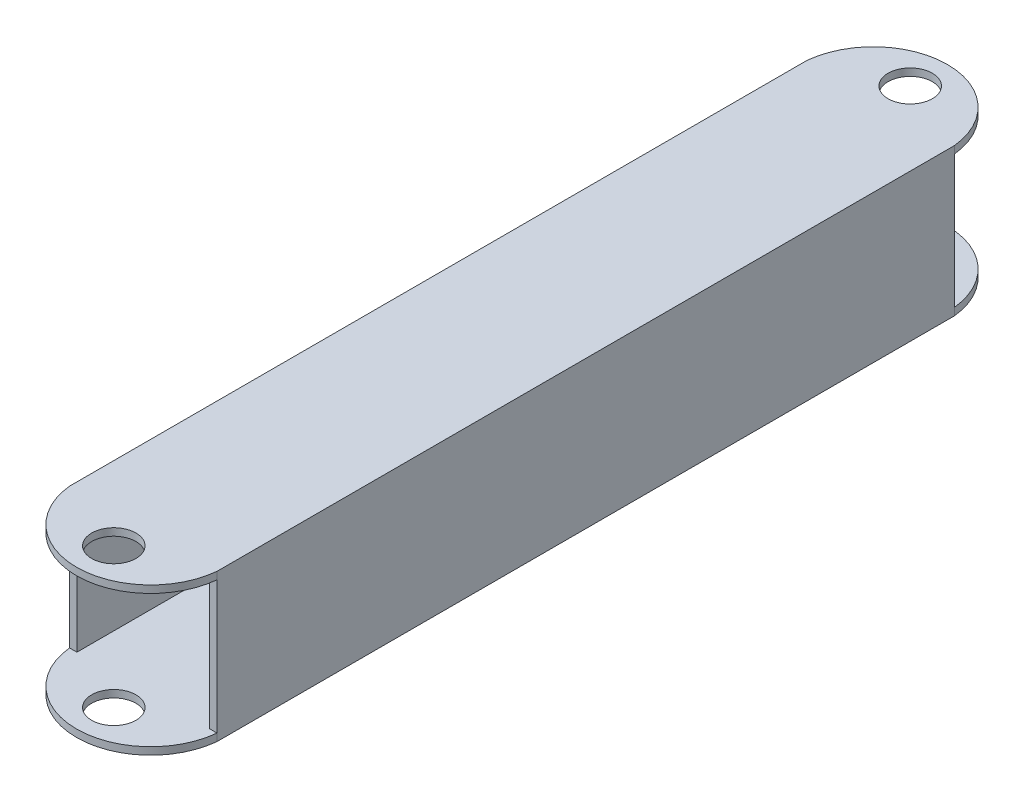
ISO-10303-21;
HEADER;
FILE_DESCRIPTION(('STEP AP214'),'2;1');
FILE_NAME('part.step','',(''),(''),'','','');
FILE_SCHEMA(('AUTOMOTIVE_DESIGN { 1 0 10303 214 1 1 1 1 }'));
ENDSEC;
DATA;
#1=APPLICATION_CONTEXT('core data for automotive mechanical design processes');
#2=APPLICATION_PROTOCOL_DEFINITION('international standard','automotive_design',2000,#1);
#3=PRODUCT_CONTEXT('',#1,'mechanical');
#4=PRODUCT('Part','Part','',(#3));
#5=PRODUCT_RELATED_PRODUCT_CATEGORY('part','',(#4));
#6=PRODUCT_DEFINITION_FORMATION('','',#4);
#7=PRODUCT_DEFINITION_CONTEXT('part definition',#1,'design');
#8=PRODUCT_DEFINITION('design','',#6,#7);
#9=PRODUCT_DEFINITION_SHAPE('','',#8);
#10=(LENGTH_UNIT() NAMED_UNIT(*) SI_UNIT(.MILLI.,.METRE.));
#11=(NAMED_UNIT(*) PLANE_ANGLE_UNIT() SI_UNIT($,.RADIAN.));
#12=(NAMED_UNIT(*) SI_UNIT($,.STERADIAN.) SOLID_ANGLE_UNIT());
#13=UNCERTAINTY_MEASURE_WITH_UNIT(LENGTH_MEASURE(1.E-05),#10,'distance_accuracy_value','');
#14=(GEOMETRIC_REPRESENTATION_CONTEXT(3) GLOBAL_UNCERTAINTY_ASSIGNED_CONTEXT((#13)) GLOBAL_UNIT_ASSIGNED_CONTEXT((#10,
#11,#12)) REPRESENTATION_CONTEXT('',''));
#15=CARTESIAN_POINT('',(0.,0.,0.));
#16=DIRECTION('',(0.,0.,1.));
#17=DIRECTION('',(1.,0.,0.));
#18=AXIS2_PLACEMENT_3D('',#15,#16,#17);
#19=CARTESIAN_POINT('',(0.,0.,50.));
#20=DIRECTION('',(0.,0.,-1.));
#21=DIRECTION('',(-1.,0.,0.));
#22=AXIS2_PLACEMENT_3D('',#19,#20,#21);
#23=PLANE('',#22);
#24=DIRECTION('',(0.,1.,0.));
#25=VECTOR('',#24,1.);
#26=CARTESIAN_POINT('',(10.,-10.,50.));
#27=LINE('',#26,#25);
#28=CARTESIAN_POINT('',(10.,-9.,50.));
#29=VERTEX_POINT('',#28);
#30=CARTESIAN_POINT('',(10.,9.,50.));
#31=VERTEX_POINT('',#30);
#32=EDGE_CURVE('E160',#29,#31,#27,.T.);
#33=ORIENTED_EDGE('',*,*,#32,.T.);
#34=DIRECTION('',(1.,0.,0.));
#35=VECTOR('',#34,1.);
#36=CARTESIAN_POINT('',(-10.,9.,50.));
#37=LINE('',#36,#35);
#38=CARTESIAN_POINT('',(9.,9.,50.));
#39=VERTEX_POINT('',#38);
#40=EDGE_CURVE('E130',#39,#31,#37,.T.);
#41=ORIENTED_EDGE('',*,*,#40,.F.);
#42=DIRECTION('',(0.,1.,0.));
#43=VECTOR('',#42,1.);
#44=CARTESIAN_POINT('',(9.,-9.,50.));
#45=LINE('',#44,#43);
#46=CARTESIAN_POINT('',(9.,-9.,50.));
#47=VERTEX_POINT('',#46);
#48=EDGE_CURVE('E274',#47,#39,#45,.T.);
#49=ORIENTED_EDGE('',*,*,#48,.F.);
#50=DIRECTION('',(1.,0.,0.));
#51=VECTOR('',#50,1.);
#52=CARTESIAN_POINT('',(-10.,-9.,50.));
#53=LINE('',#52,#51);
#54=EDGE_CURVE('E165',#47,#29,#53,.T.);
#55=ORIENTED_EDGE('',*,*,#54,.T.);
#56=EDGE_LOOP('',(#33,#41,#49,#55));
#57=FACE_BOUND('',#56,.T.);
#58=ADVANCED_FACE('F39',(#57),#23,.F.);
#59=CARTESIAN_POINT('',(0.,0.,-50.));
#60=DIRECTION('',(0.,0.,-1.));
#61=DIRECTION('',(-1.,0.,0.));
#62=AXIS2_PLACEMENT_3D('',#59,#60,#61);
#63=PLANE('',#62);
#64=DIRECTION('',(1.,0.,0.));
#65=VECTOR('',#64,1.);
#66=CARTESIAN_POINT('',(-10.,9.,-50.));
#67=LINE('',#66,#65);
#68=CARTESIAN_POINT('',(9.,9.,-50.));
#69=VERTEX_POINT('',#68);
#70=CARTESIAN_POINT('',(10.,9.,-50.));
#71=VERTEX_POINT('',#70);
#72=EDGE_CURVE('E55',#69,#71,#67,.T.);
#73=ORIENTED_EDGE('',*,*,#72,.T.);
#74=DIRECTION('',(0.,1.,0.));
#75=VECTOR('',#74,1.);
#76=CARTESIAN_POINT('',(10.,-10.,-50.));
#77=LINE('',#76,#75);
#78=CARTESIAN_POINT('',(10.,-9.,-50.));
#79=VERTEX_POINT('',#78);
#80=EDGE_CURVE('E183',#79,#71,#77,.T.);
#81=ORIENTED_EDGE('',*,*,#80,.F.);
#82=DIRECTION('',(1.,0.,0.));
#83=VECTOR('',#82,1.);
#84=CARTESIAN_POINT('',(-10.,-9.,-50.));
#85=LINE('',#84,#83);
#86=CARTESIAN_POINT('',(9.,-9.,-50.));
#87=VERTEX_POINT('',#86);
#88=EDGE_CURVE('E236',#87,#79,#85,.T.);
#89=ORIENTED_EDGE('',*,*,#88,.F.);
#90=DIRECTION('',(0.,1.,0.));
#91=VECTOR('',#90,1.);
#92=CARTESIAN_POINT('',(9.,-9.,-50.));
#93=LINE('',#92,#91);
#94=EDGE_CURVE('E275',#87,#69,#93,.T.);
#95=ORIENTED_EDGE('',*,*,#94,.T.);
#96=EDGE_LOOP('',(#73,#81,#89,#95));
#97=FACE_BOUND('',#96,.T.);
#98=ADVANCED_FACE('F363',(#97),#63,.T.);
#99=DIRECTION('',(0.,-1.,0.));
#100=VECTOR('',#99,1.);
#101=CARTESIAN_POINT('',(-9.,-9.,50.));
#102=LINE('',#101,#100);
#103=CARTESIAN_POINT('',(-9.,9.,50.));
#104=VERTEX_POINT('',#103);
#105=CARTESIAN_POINT('',(-9.,-9.,50.));
#106=VERTEX_POINT('',#105);
#107=EDGE_CURVE('E270',#104,#106,#102,.T.);
#108=ORIENTED_EDGE('',*,*,#107,.F.);
#109=CARTESIAN_POINT('',(-10.,9.,50.));
#110=VERTEX_POINT('',#109);
#111=EDGE_CURVE('E142',#110,#104,#37,.T.);
#112=ORIENTED_EDGE('',*,*,#111,.F.);
#113=DIRECTION('',(0.,-1.,0.));
#114=VECTOR('',#113,1.);
#115=CARTESIAN_POINT('',(-10.,-10.,50.));
#116=LINE('',#115,#114);
#117=CARTESIAN_POINT('',(-10.,-9.,50.));
#118=VERTEX_POINT('',#117);
#119=EDGE_CURVE('E172',#110,#118,#116,.T.);
#120=ORIENTED_EDGE('',*,*,#119,.T.);
#121=EDGE_CURVE('E260',#118,#106,#53,.T.);
#122=ORIENTED_EDGE('',*,*,#121,.T.);
#123=EDGE_LOOP('',(#108,#112,#120,#122));
#124=FACE_BOUND('',#123,.T.);
#125=ADVANCED_FACE('F325',(#124),#23,.F.);
#126=CARTESIAN_POINT('',(-10.,9.,-50.));
#127=VERTEX_POINT('',#126);
#128=CARTESIAN_POINT('',(-9.,9.,-50.));
#129=VERTEX_POINT('',#128);
#130=EDGE_CURVE('E219',#127,#129,#67,.T.);
#131=ORIENTED_EDGE('',*,*,#130,.T.);
#132=DIRECTION('',(0.,-1.,0.));
#133=VECTOR('',#132,1.);
#134=CARTESIAN_POINT('',(-9.,-9.,-50.));
#135=LINE('',#134,#133);
#136=CARTESIAN_POINT('',(-9.,-9.,-50.));
#137=VERTEX_POINT('',#136);
#138=EDGE_CURVE('E269',#129,#137,#135,.T.);
#139=ORIENTED_EDGE('',*,*,#138,.T.);
#140=CARTESIAN_POINT('',(-10.,-9.,-50.));
#141=VERTEX_POINT('',#140);
#142=EDGE_CURVE('E237',#141,#137,#85,.T.);
#143=ORIENTED_EDGE('',*,*,#142,.F.);
#144=DIRECTION('',(0.,-1.,0.));
#145=VECTOR('',#144,1.);
#146=CARTESIAN_POINT('',(-10.,-10.,-50.));
#147=LINE('',#146,#145);
#148=EDGE_CURVE('E63',#127,#141,#147,.T.);
#149=ORIENTED_EDGE('',*,*,#148,.F.);
#150=EDGE_LOOP('',(#131,#139,#143,#149));
#151=FACE_BOUND('',#150,.T.);
#152=ADVANCED_FACE('F369',(#151),#63,.T.);
#153=CARTESIAN_POINT('',(10.,-10.,50.));
#154=DIRECTION('',(-1.,0.,0.));
#155=DIRECTION('',(0.,0.,1.));
#156=AXIS2_PLACEMENT_3D('',#153,#154,#155);
#157=PLANE('',#156);
#158=CARTESIAN_POINT('',(10.,-10.,-50.));
#159=VERTEX_POINT('',#158);
#160=EDGE_CURVE('E181',#159,#79,#77,.T.);
#161=ORIENTED_EDGE('',*,*,#160,.T.);
#162=ORIENTED_EDGE('',*,*,#80,.T.);
#163=DIRECTION('',(0.,1.,0.));
#164=VECTOR('',#163,1.);
#165=CARTESIAN_POINT('',(10.,9.,-50.));
#166=LINE('',#165,#164);
#167=CARTESIAN_POINT('',(10.,10.,-50.));
#168=VERTEX_POINT('',#167);
#169=EDGE_CURVE('E220',#71,#168,#166,.T.);
#170=ORIENTED_EDGE('',*,*,#169,.T.);
#171=DIRECTION('',(0.,0.,-1.));
#172=VECTOR('',#171,1.);
#173=CARTESIAN_POINT('',(10.,10.,50.));
#174=LINE('',#173,#172);
#175=CARTESIAN_POINT('',(10.,10.,50.));
#176=VERTEX_POINT('',#175);
#177=EDGE_CURVE('E11',#176,#168,#174,.T.);
#178=ORIENTED_EDGE('',*,*,#177,.F.);
#179=DIRECTION('',(0.,1.,0.));
#180=VECTOR('',#179,1.);
#181=CARTESIAN_POINT('',(10.,9.,50.));
#182=LINE('',#181,#180);
#183=EDGE_CURVE('E147',#31,#176,#182,.T.);
#184=ORIENTED_EDGE('',*,*,#183,.F.);
#185=ORIENTED_EDGE('',*,*,#32,.F.);
#186=CARTESIAN_POINT('',(10.,-10.,50.));
#187=VERTEX_POINT('',#186);
#188=EDGE_CURVE('E167',#187,#29,#27,.T.);
#189=ORIENTED_EDGE('',*,*,#188,.F.);
#190=DIRECTION('',(0.,0.,-1.));
#191=VECTOR('',#190,1.);
#192=CARTESIAN_POINT('',(10.,-10.,50.));
#193=LINE('',#192,#191);
#194=EDGE_CURVE('E180',#187,#159,#193,.T.);
#195=ORIENTED_EDGE('',*,*,#194,.T.);
#196=EDGE_LOOP('',(#161,#162,#170,#178,#184,#185,#189,#195));
#197=FACE_BOUND('',#196,.T.);
#198=ADVANCED_FACE('F41',(#197),#157,.F.);
#199=CARTESIAN_POINT('',(-10.,10.,50.));
#200=DIRECTION('',(0.,-1.,0.));
#201=DIRECTION('',(0.,0.,-1.));
#202=AXIS2_PLACEMENT_3D('',#199,#200,#201);
#203=PLANE('',#202);
#204=ORIENTED_EDGE('',*,*,#177,.T.);
#205=CARTESIAN_POINT('',(0.,10.,-49.));
#206=DIRECTION('',(0.,1.,0.));
#207=DIRECTION('',(0.,0.,-1.));
#208=AXIS2_PLACEMENT_3D('',#205,#206,#207);
#209=CIRCLE('',#208,10.0498756211209);
#210=CARTESIAN_POINT('',(-10.,10.,-50.));
#211=VERTEX_POINT('',#210);
#212=EDGE_CURVE('E203',#168,#211,#209,.T.);
#213=ORIENTED_EDGE('',*,*,#212,.T.);
#214=DIRECTION('',(0.,0.,-1.));
#215=VECTOR('',#214,1.);
#216=CARTESIAN_POINT('',(-10.,10.,50.));
#217=LINE('',#216,#215);
#218=CARTESIAN_POINT('',(-10.,10.,50.));
#219=VERTEX_POINT('',#218);
#220=EDGE_CURVE('E48',#219,#211,#217,.T.);
#221=ORIENTED_EDGE('',*,*,#220,.F.);
#222=CARTESIAN_POINT('',(0.,10.,49.));
#223=DIRECTION('',(0.,-1.,0.));
#224=DIRECTION('',(0.,0.,1.));
#225=AXIS2_PLACEMENT_3D('',#222,#223,#224);
#226=CIRCLE('',#225,10.0498756211209);
#227=EDGE_CURVE('E153',#176,#219,#226,.T.);
#228=ORIENTED_EDGE('',*,*,#227,.F.);
#229=EDGE_LOOP('',(#204,#213,#221,#228));
#230=FACE_BOUND('',#229,.T.);
#231=CARTESIAN_POINT('',(0.,10.,-54.));
#232=DIRECTION('',(0.,1.,0.));
#233=DIRECTION('',(0.,0.,1.));
#234=AXIS2_PLACEMENT_3D('',#231,#232,#233);
#235=CIRCLE('',#234,3.);
#236=CARTESIAN_POINT('',(0.,10.,-51.));
#237=VERTEX_POINT('',#236);
#238=EDGE_CURVE('E162',#237,#237,#235,.T.);
#239=ORIENTED_EDGE('',*,*,#238,.F.);
#240=EDGE_LOOP('',(#239));
#241=FACE_BOUND('',#240,.T.);
#242=CARTESIAN_POINT('',(0.,10.,54.));
#243=DIRECTION('',(0.,-1.,0.));
#244=DIRECTION('',(0.,0.,-1.));
#245=AXIS2_PLACEMENT_3D('',#242,#243,#244);
#246=CIRCLE('',#245,3.);
#247=CARTESIAN_POINT('',(0.,10.,51.));
#248=VERTEX_POINT('',#247);
#249=EDGE_CURVE('E341',#248,#248,#246,.T.);
#250=ORIENTED_EDGE('',*,*,#249,.T.);
#251=EDGE_LOOP('',(#250));
#252=FACE_BOUND('',#251,.T.);
#253=ADVANCED_FACE('F207',(#230,#241,#252),#203,.F.);
#254=CARTESIAN_POINT('',(-10.,-10.,50.));
#255=DIRECTION('',(1.,0.,0.));
#256=DIRECTION('',(0.,0.,-1.));
#257=AXIS2_PLACEMENT_3D('',#254,#255,#256);
#258=PLANE('',#257);
#259=EDGE_CURVE('E168',#211,#127,#147,.T.);
#260=ORIENTED_EDGE('',*,*,#259,.T.);
#261=ORIENTED_EDGE('',*,*,#148,.T.);
#262=DIRECTION('',(0.,-1.,0.));
#263=VECTOR('',#262,1.);
#264=CARTESIAN_POINT('',(-10.,-9.,-50.));
#265=LINE('',#264,#263);
#266=CARTESIAN_POINT('',(-10.,-10.,-50.));
#267=VERTEX_POINT('',#266);
#268=EDGE_CURVE('E241',#141,#267,#265,.T.);
#269=ORIENTED_EDGE('',*,*,#268,.T.);
#270=DIRECTION('',(0.,0.,-1.));
#271=VECTOR('',#270,1.);
#272=CARTESIAN_POINT('',(-10.,-10.,50.));
#273=LINE('',#272,#271);
#274=CARTESIAN_POINT('',(-10.,-10.,50.));
#275=VERTEX_POINT('',#274);
#276=EDGE_CURVE('E187',#275,#267,#273,.T.);
#277=ORIENTED_EDGE('',*,*,#276,.F.);
#278=DIRECTION('',(0.,-1.,0.));
#279=VECTOR('',#278,1.);
#280=CARTESIAN_POINT('',(-10.,-9.,50.));
#281=LINE('',#280,#279);
#282=EDGE_CURVE('E263',#118,#275,#281,.T.);
#283=ORIENTED_EDGE('',*,*,#282,.F.);
#284=ORIENTED_EDGE('',*,*,#119,.F.);
#285=EDGE_CURVE('E150',#219,#110,#116,.T.);
#286=ORIENTED_EDGE('',*,*,#285,.F.);
#287=ORIENTED_EDGE('',*,*,#220,.T.);
#288=EDGE_LOOP('',(#260,#261,#269,#277,#283,#284,#286,#287));
#289=FACE_BOUND('',#288,.T.);
#290=ADVANCED_FACE('F194',(#289),#258,.F.);
#291=CARTESIAN_POINT('',(-10.,-10.,50.));
#292=DIRECTION('',(0.,1.,0.));
#293=DIRECTION('',(0.,0.,1.));
#294=AXIS2_PLACEMENT_3D('',#291,#292,#293);
#295=PLANE('',#294);
#296=ORIENTED_EDGE('',*,*,#276,.T.);
#297=CARTESIAN_POINT('',(0.,-10.,-49.));
#298=DIRECTION('',(0.,1.,0.));
#299=DIRECTION('',(0.,0.,-1.));
#300=AXIS2_PLACEMENT_3D('',#297,#298,#299);
#301=CIRCLE('',#300,10.0498756211209);
#302=EDGE_CURVE('E228',#159,#267,#301,.T.);
#303=ORIENTED_EDGE('',*,*,#302,.F.);
#304=ORIENTED_EDGE('',*,*,#194,.F.);
#305=CARTESIAN_POINT('',(0.,-10.,49.));
#306=DIRECTION('',(0.,-1.,0.));
#307=DIRECTION('',(0.,0.,1.));
#308=AXIS2_PLACEMENT_3D('',#305,#306,#307);
#309=CIRCLE('',#308,10.0498756211209);
#310=EDGE_CURVE('E252',#187,#275,#309,.T.);
#311=ORIENTED_EDGE('',*,*,#310,.T.);
#312=EDGE_LOOP('',(#296,#303,#304,#311));
#313=FACE_BOUND('',#312,.T.);
#314=CARTESIAN_POINT('',(0.,-10.,54.));
#315=DIRECTION('',(0.,-1.,0.));
#316=DIRECTION('',(0.,0.,-1.));
#317=AXIS2_PLACEMENT_3D('',#314,#315,#316);
#318=CIRCLE('',#317,3.);
#319=CARTESIAN_POINT('',(0.,-10.,51.));
#320=VERTEX_POINT('',#319);
#321=EDGE_CURVE('E247',#320,#320,#318,.T.);
#322=ORIENTED_EDGE('',*,*,#321,.F.);
#323=EDGE_LOOP('',(#322));
#324=FACE_BOUND('',#323,.T.);
#325=CARTESIAN_POINT('',(0.,-10.,-54.));
#326=DIRECTION('',(0.,1.,0.));
#327=DIRECTION('',(0.,0.,1.));
#328=AXIS2_PLACEMENT_3D('',#325,#326,#327);
#329=CIRCLE('',#328,3.);
#330=CARTESIAN_POINT('',(0.,-10.,-51.));
#331=VERTEX_POINT('',#330);
#332=EDGE_CURVE('E223',#331,#331,#329,.T.);
#333=ORIENTED_EDGE('',*,*,#332,.T.);
#334=EDGE_LOOP('',(#333));
#335=FACE_BOUND('',#334,.T.);
#336=ADVANCED_FACE('F315',(#313,#324,#335),#295,.F.);
#337=CARTESIAN_POINT('',(-9.,-9.,50.));
#338=DIRECTION('',(1.,0.,0.));
#339=DIRECTION('',(0.,0.,-1.));
#340=AXIS2_PLACEMENT_3D('',#337,#338,#339);
#341=PLANE('',#340);
#342=ORIENTED_EDGE('',*,*,#138,.F.);
#343=DIRECTION('',(0.,0.,-1.));
#344=VECTOR('',#343,1.);
#345=CARTESIAN_POINT('',(-9.,9.,50.));
#346=LINE('',#345,#344);
#347=EDGE_CURVE('E278',#104,#129,#346,.T.);
#348=ORIENTED_EDGE('',*,*,#347,.F.);
#349=ORIENTED_EDGE('',*,*,#107,.T.);
#350=DIRECTION('',(0.,0.,-1.));
#351=VECTOR('',#350,1.);
#352=CARTESIAN_POINT('',(-9.,-9.,50.));
#353=LINE('',#352,#351);
#354=EDGE_CURVE('E176',#106,#137,#353,.T.);
#355=ORIENTED_EDGE('',*,*,#354,.T.);
#356=EDGE_LOOP('',(#342,#348,#349,#355));
#357=FACE_BOUND('',#356,.T.);
#358=ADVANCED_FACE('F381',(#357),#341,.T.);
#359=CARTESIAN_POINT('',(-9.,-9.,50.));
#360=DIRECTION('',(0.,1.,0.));
#361=DIRECTION('',(0.,0.,1.));
#362=AXIS2_PLACEMENT_3D('',#359,#360,#361);
#363=PLANE('',#362);
#364=DIRECTION('',(0.,0.,-1.));
#365=VECTOR('',#364,1.);
#366=CARTESIAN_POINT('',(9.,-9.,50.));
#367=LINE('',#366,#365);
#368=EDGE_CURVE('E287',#47,#87,#367,.T.);
#369=ORIENTED_EDGE('',*,*,#368,.T.);
#370=ORIENTED_EDGE('',*,*,#88,.T.);
#371=CARTESIAN_POINT('',(0.,-9.,-49.));
#372=DIRECTION('',(0.,1.,0.));
#373=DIRECTION('',(0.,0.,-1.));
#374=AXIS2_PLACEMENT_3D('',#371,#372,#373);
#375=CIRCLE('',#374,10.0498756211209);
#376=EDGE_CURVE('E232',#79,#141,#375,.T.);
#377=ORIENTED_EDGE('',*,*,#376,.T.);
#378=ORIENTED_EDGE('',*,*,#142,.T.);
#379=ORIENTED_EDGE('',*,*,#354,.F.);
#380=ORIENTED_EDGE('',*,*,#121,.F.);
#381=CARTESIAN_POINT('',(0.,-9.,49.));
#382=DIRECTION('',(0.,-1.,0.));
#383=DIRECTION('',(0.,0.,1.));
#384=AXIS2_PLACEMENT_3D('',#381,#382,#383);
#385=CIRCLE('',#384,10.0498756211209);
#386=EDGE_CURVE('E256',#29,#118,#385,.T.);
#387=ORIENTED_EDGE('',*,*,#386,.F.);
#388=ORIENTED_EDGE('',*,*,#54,.F.);
#389=EDGE_LOOP('',(#369,#370,#377,#378,#379,#380,#387,#388));
#390=FACE_BOUND('',#389,.T.);
#391=CARTESIAN_POINT('',(0.,-9.,54.));
#392=DIRECTION('',(0.,-1.,0.));
#393=DIRECTION('',(0.,0.,-1.));
#394=AXIS2_PLACEMENT_3D('',#391,#392,#393);
#395=CIRCLE('',#394,3.);
#396=CARTESIAN_POINT('',(0.,-9.,51.));
#397=VERTEX_POINT('',#396);
#398=EDGE_CURVE('E248',#397,#397,#395,.T.);
#399=ORIENTED_EDGE('',*,*,#398,.T.);
#400=EDGE_LOOP('',(#399));
#401=FACE_BOUND('',#400,.T.);
#402=CARTESIAN_POINT('',(0.,-9.,-54.));
#403=DIRECTION('',(0.,1.,0.));
#404=DIRECTION('',(0.,0.,1.));
#405=AXIS2_PLACEMENT_3D('',#402,#403,#404);
#406=CIRCLE('',#405,3.);
#407=CARTESIAN_POINT('',(0.,-9.,-51.));
#408=VERTEX_POINT('',#407);
#409=EDGE_CURVE('E224',#408,#408,#406,.T.);
#410=ORIENTED_EDGE('',*,*,#409,.F.);
#411=EDGE_LOOP('',(#410));
#412=FACE_BOUND('',#411,.T.);
#413=ADVANCED_FACE('F306',(#390,#401,#412),#363,.T.);
#414=CARTESIAN_POINT('',(9.,-9.,50.));
#415=DIRECTION('',(-1.,0.,0.));
#416=DIRECTION('',(0.,0.,1.));
#417=AXIS2_PLACEMENT_3D('',#414,#415,#416);
#418=PLANE('',#417);
#419=ORIENTED_EDGE('',*,*,#94,.F.);
#420=ORIENTED_EDGE('',*,*,#368,.F.);
#421=ORIENTED_EDGE('',*,*,#48,.T.);
#422=DIRECTION('',(0.,0.,-1.));
#423=VECTOR('',#422,1.);
#424=CARTESIAN_POINT('',(9.,9.,50.));
#425=LINE('',#424,#423);
#426=EDGE_CURVE('E136',#39,#69,#425,.T.);
#427=ORIENTED_EDGE('',*,*,#426,.T.);
#428=EDGE_LOOP('',(#419,#420,#421,#427));
#429=FACE_BOUND('',#428,.T.);
#430=ADVANCED_FACE('F352',(#429),#418,.T.);
#431=CARTESIAN_POINT('',(-9.,9.,50.));
#432=DIRECTION('',(0.,-1.,0.));
#433=DIRECTION('',(0.,0.,-1.));
#434=AXIS2_PLACEMENT_3D('',#431,#432,#433);
#435=PLANE('',#434);
#436=ORIENTED_EDGE('',*,*,#347,.T.);
#437=ORIENTED_EDGE('',*,*,#130,.F.);
#438=CARTESIAN_POINT('',(0.,9.,-49.));
#439=DIRECTION('',(0.,1.,0.));
#440=DIRECTION('',(0.,0.,-1.));
#441=AXIS2_PLACEMENT_3D('',#438,#439,#440);
#442=CIRCLE('',#441,10.0498756211209);
#443=EDGE_CURVE('E205',#71,#127,#442,.T.);
#444=ORIENTED_EDGE('',*,*,#443,.F.);
#445=ORIENTED_EDGE('',*,*,#72,.F.);
#446=ORIENTED_EDGE('',*,*,#426,.F.);
#447=ORIENTED_EDGE('',*,*,#40,.T.);
#448=CARTESIAN_POINT('',(0.,9.,49.));
#449=DIRECTION('',(0.,-1.,0.));
#450=DIRECTION('',(0.,0.,1.));
#451=AXIS2_PLACEMENT_3D('',#448,#449,#450);
#452=CIRCLE('',#451,10.0498756211209);
#453=EDGE_CURVE('E134',#31,#110,#452,.T.);
#454=ORIENTED_EDGE('',*,*,#453,.T.);
#455=ORIENTED_EDGE('',*,*,#111,.T.);
#456=EDGE_LOOP('',(#436,#437,#444,#445,#446,#447,#454,#455));
#457=FACE_BOUND('',#456,.T.);
#458=CARTESIAN_POINT('',(0.,9.,-54.));
#459=DIRECTION('',(0.,1.,0.));
#460=DIRECTION('',(0.,0.,1.));
#461=AXIS2_PLACEMENT_3D('',#458,#459,#460);
#462=CIRCLE('',#461,3.);
#463=CARTESIAN_POINT('',(0.,9.,-51.));
#464=VERTEX_POINT('',#463);
#465=EDGE_CURVE('E210',#464,#464,#462,.T.);
#466=ORIENTED_EDGE('',*,*,#465,.T.);
#467=EDGE_LOOP('',(#466));
#468=FACE_BOUND('',#467,.T.);
#469=CARTESIAN_POINT('',(0.,9.,54.));
#470=DIRECTION('',(0.,-1.,0.));
#471=DIRECTION('',(0.,0.,-1.));
#472=AXIS2_PLACEMENT_3D('',#469,#470,#471);
#473=CIRCLE('',#472,3.);
#474=CARTESIAN_POINT('',(0.,9.,51.));
#475=VERTEX_POINT('',#474);
#476=EDGE_CURVE('E330',#475,#475,#473,.T.);
#477=ORIENTED_EDGE('',*,*,#476,.F.);
#478=EDGE_LOOP('',(#477));
#479=FACE_BOUND('',#478,.T.);
#480=ADVANCED_FACE('F132',(#457,#468,#479),#435,.T.);
#481=CARTESIAN_POINT('',(0.,-9.,49.));
#482=DIRECTION('',(0.,-1.,0.));
#483=DIRECTION('',(0.,0.,-1.));
#484=AXIS2_PLACEMENT_3D('',#481,#482,#483);
#485=CYLINDRICAL_SURFACE('',#484,10.0498756211209);
#486=ORIENTED_EDGE('',*,*,#310,.F.);
#487=ORIENTED_EDGE('',*,*,#188,.T.);
#488=ORIENTED_EDGE('',*,*,#386,.T.);
#489=ORIENTED_EDGE('',*,*,#282,.T.);
#490=EDGE_LOOP('',(#486,#487,#488,#489));
#491=FACE_BOUND('',#490,.T.);
#492=ADVANCED_FACE('F319',(#491),#485,.T.);
#493=CARTESIAN_POINT('',(0.,-9.,54.));
#494=DIRECTION('',(0.,-1.,0.));
#495=DIRECTION('',(0.,0.,-1.));
#496=AXIS2_PLACEMENT_3D('',#493,#494,#495);
#497=CYLINDRICAL_SURFACE('',#496,3.);
#498=ORIENTED_EDGE('',*,*,#398,.F.);
#499=EDGE_LOOP('',(#498));
#500=FACE_BOUND('',#499,.T.);
#501=ORIENTED_EDGE('',*,*,#321,.T.);
#502=EDGE_LOOP('',(#501));
#503=FACE_BOUND('',#502,.T.);
#504=ADVANCED_FACE('F358',(#500,#503),#497,.F.);
#505=CARTESIAN_POINT('',(0.,-9.,-49.));
#506=DIRECTION('',(0.,-1.,0.));
#507=DIRECTION('',(0.,0.,-1.));
#508=AXIS2_PLACEMENT_3D('',#505,#506,#507);
#509=CYLINDRICAL_SURFACE('',#508,10.0498756211209);
#510=ORIENTED_EDGE('',*,*,#302,.T.);
#511=ORIENTED_EDGE('',*,*,#268,.F.);
#512=ORIENTED_EDGE('',*,*,#376,.F.);
#513=ORIENTED_EDGE('',*,*,#160,.F.);
#514=EDGE_LOOP('',(#510,#511,#512,#513));
#515=FACE_BOUND('',#514,.T.);
#516=ADVANCED_FACE('F310',(#515),#509,.T.);
#517=CARTESIAN_POINT('',(0.,-9.,-54.));
#518=DIRECTION('',(0.,-1.,0.));
#519=DIRECTION('',(0.,0.,-1.));
#520=AXIS2_PLACEMENT_3D('',#517,#518,#519);
#521=CYLINDRICAL_SURFACE('',#520,3.);
#522=ORIENTED_EDGE('',*,*,#409,.T.);
#523=EDGE_LOOP('',(#522));
#524=FACE_BOUND('',#523,.T.);
#525=ORIENTED_EDGE('',*,*,#332,.F.);
#526=EDGE_LOOP('',(#525));
#527=FACE_BOUND('',#526,.T.);
#528=ADVANCED_FACE('F424',(#524,#527),#521,.F.);
#529=CARTESIAN_POINT('',(0.,9.,-49.));
#530=DIRECTION('',(0.,1.,0.));
#531=DIRECTION('',(0.,0.,1.));
#532=AXIS2_PLACEMENT_3D('',#529,#530,#531);
#533=CYLINDRICAL_SURFACE('',#532,10.0498756211209);
#534=ORIENTED_EDGE('',*,*,#212,.F.);
#535=ORIENTED_EDGE('',*,*,#169,.F.);
#536=ORIENTED_EDGE('',*,*,#443,.T.);
#537=ORIENTED_EDGE('',*,*,#259,.F.);
#538=EDGE_LOOP('',(#534,#535,#536,#537));
#539=FACE_BOUND('',#538,.T.);
#540=ADVANCED_FACE('F201',(#539),#533,.T.);
#541=CARTESIAN_POINT('',(0.,9.,-54.));
#542=DIRECTION('',(0.,1.,0.));
#543=DIRECTION('',(0.,0.,1.));
#544=AXIS2_PLACEMENT_3D('',#541,#542,#543);
#545=CYLINDRICAL_SURFACE('',#544,3.);
#546=ORIENTED_EDGE('',*,*,#465,.F.);
#547=EDGE_LOOP('',(#546));
#548=FACE_BOUND('',#547,.T.);
#549=ORIENTED_EDGE('',*,*,#238,.T.);
#550=EDGE_LOOP('',(#549));
#551=FACE_BOUND('',#550,.T.);
#552=ADVANCED_FACE('F336',(#548,#551),#545,.F.);
#553=CARTESIAN_POINT('',(0.,9.,49.));
#554=DIRECTION('',(0.,1.,0.));
#555=DIRECTION('',(0.,0.,1.));
#556=AXIS2_PLACEMENT_3D('',#553,#554,#555);
#557=CYLINDRICAL_SURFACE('',#556,10.0498756211209);
#558=ORIENTED_EDGE('',*,*,#227,.T.);
#559=ORIENTED_EDGE('',*,*,#285,.T.);
#560=ORIENTED_EDGE('',*,*,#453,.F.);
#561=ORIENTED_EDGE('',*,*,#183,.T.);
#562=EDGE_LOOP('',(#558,#559,#560,#561));
#563=FACE_BOUND('',#562,.T.);
#564=ADVANCED_FACE('F146',(#563),#557,.T.);
#565=CARTESIAN_POINT('',(0.,9.,54.));
#566=DIRECTION('',(0.,1.,0.));
#567=DIRECTION('',(0.,0.,1.));
#568=AXIS2_PLACEMENT_3D('',#565,#566,#567);
#569=CYLINDRICAL_SURFACE('',#568,3.);
#570=ORIENTED_EDGE('',*,*,#476,.T.);
#571=EDGE_LOOP('',(#570));
#572=FACE_BOUND('',#571,.T.);
#573=ORIENTED_EDGE('',*,*,#249,.F.);
#574=EDGE_LOOP('',(#573));
#575=FACE_BOUND('',#574,.T.);
#576=ADVANCED_FACE('F349',(#572,#575),#569,.F.);
#577=CLOSED_SHELL('',(#58,#98,#125,#152,#198,#253,#290,#336,#358,#413,#430,#480,#492,#504,#516,
#528,#540,#552,#564,#576));
#578=MANIFOLD_SOLID_BREP('B2',#577);
#579=ADVANCED_BREP_SHAPE_REPRESENTATION('',(#18,#578),#14);
#580=SHAPE_DEFINITION_REPRESENTATION(#9,#579);
ENDSEC;
END-ISO-10303-21;
